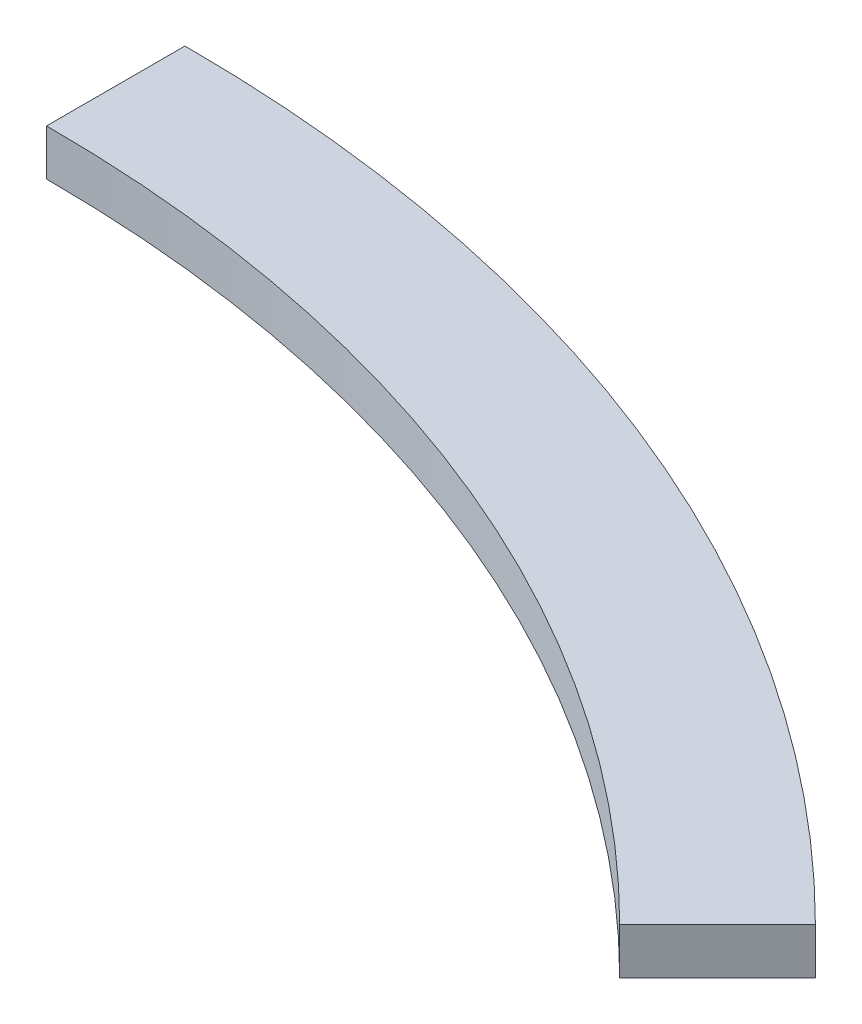
ISO-10303-21;
HEADER;
FILE_DESCRIPTION(('STEP AP214'),'2;1');
FILE_NAME('part.step','',(''),(''),'','','');
FILE_SCHEMA(('AUTOMOTIVE_DESIGN { 1 0 10303 214 1 1 1 1 }'));
ENDSEC;
DATA;
#1=APPLICATION_CONTEXT('core data for automotive mechanical design processes');
#2=APPLICATION_PROTOCOL_DEFINITION('international standard','automotive_design',2000,#1);
#3=PRODUCT_CONTEXT('',#1,'mechanical');
#4=PRODUCT('Part','Part','',(#3));
#5=PRODUCT_RELATED_PRODUCT_CATEGORY('part','',(#4));
#6=PRODUCT_DEFINITION_FORMATION('','',#4);
#7=PRODUCT_DEFINITION_CONTEXT('part definition',#1,'design');
#8=PRODUCT_DEFINITION('design','',#6,#7);
#9=PRODUCT_DEFINITION_SHAPE('','',#8);
#10=(LENGTH_UNIT() NAMED_UNIT(*) SI_UNIT(.MILLI.,.METRE.));
#11=(NAMED_UNIT(*) PLANE_ANGLE_UNIT() SI_UNIT($,.RADIAN.));
#12=(NAMED_UNIT(*) SI_UNIT($,.STERADIAN.) SOLID_ANGLE_UNIT());
#13=UNCERTAINTY_MEASURE_WITH_UNIT(LENGTH_MEASURE(1.E-05),#10,'distance_accuracy_value','');
#14=(GEOMETRIC_REPRESENTATION_CONTEXT(3) GLOBAL_UNCERTAINTY_ASSIGNED_CONTEXT((#13)) GLOBAL_UNIT_ASSIGNED_CONTEXT((#10,
#11,#12)) REPRESENTATION_CONTEXT('',''));
#15=CARTESIAN_POINT('',(0.,0.,0.));
#16=DIRECTION('',(0.,0.,1.));
#17=DIRECTION('',(1.,0.,0.));
#18=AXIS2_PLACEMENT_3D('',#15,#16,#17);
#19=CARTESIAN_POINT('',(0.,10.,0.));
#20=DIRECTION('',(0.,-1.,0.));
#21=DIRECTION('',(0.,0.,-1.));
#22=AXIS2_PLACEMENT_3D('',#19,#20,#21);
#23=CYLINDRICAL_SURFACE('',#22,330.);
#24=CARTESIAN_POINT('',(0.,0.,0.));
#25=DIRECTION('',(0.,1.,0.));
#26=DIRECTION('',(0.,0.,1.));
#27=AXIS2_PLACEMENT_3D('',#24,#25,#26);
#28=CIRCLE('',#27,330.);
#29=CARTESIAN_POINT('',(0.,0.,-330.));
#30=VERTEX_POINT('',#29);
#31=CARTESIAN_POINT('',(233.345237791561,0.,-233.34523779156));
#32=VERTEX_POINT('',#31);
#33=EDGE_CURVE('E99',#30,#32,#28,.F.);
#34=ORIENTED_EDGE('',*,*,#33,.F.);
#35=DIRECTION('',(0.,-1.,0.));
#36=VECTOR('',#35,1.);
#37=CARTESIAN_POINT('',(0.,10.,-330.));
#38=LINE('',#37,#36);
#39=CARTESIAN_POINT('',(0.,10.,-330.));
#40=VERTEX_POINT('',#39);
#41=EDGE_CURVE('E11',#40,#30,#38,.T.);
#42=ORIENTED_EDGE('',*,*,#41,.F.);
#43=CARTESIAN_POINT('',(0.,10.,0.));
#44=DIRECTION('',(0.,1.,0.));
#45=DIRECTION('',(0.,0.,1.));
#46=AXIS2_PLACEMENT_3D('',#43,#44,#45);
#47=CIRCLE('',#46,330.);
#48=CARTESIAN_POINT('',(233.345237791561,10.,-233.34523779156));
#49=VERTEX_POINT('',#48);
#50=EDGE_CURVE('E93',#40,#49,#47,.F.);
#51=ORIENTED_EDGE('',*,*,#50,.T.);
#52=DIRECTION('',(0.,-1.,0.));
#53=VECTOR('',#52,1.);
#54=CARTESIAN_POINT('',(233.345237791561,10.,-233.34523779156));
#55=LINE('',#54,#53);
#56=EDGE_CURVE('E74',#49,#32,#55,.T.);
#57=ORIENTED_EDGE('',*,*,#56,.T.);
#58=EDGE_LOOP('',(#34,#42,#51,#57));
#59=FACE_BOUND('',#58,.T.);
#60=ADVANCED_FACE('F36',(#59),#23,.T.);
#61=CARTESIAN_POINT('',(0.,10.,0.));
#62=DIRECTION('',(-1.,0.,0.));
#63=DIRECTION('',(0.,0.,1.));
#64=AXIS2_PLACEMENT_3D('',#61,#62,#63);
#65=PLANE('',#64);
#66=DIRECTION('',(0.,0.,-1.));
#67=VECTOR('',#66,1.);
#68=CARTESIAN_POINT('',(0.,0.,0.));
#69=LINE('',#68,#67);
#70=CARTESIAN_POINT('',(0.,0.,-300.));
#71=VERTEX_POINT('',#70);
#72=EDGE_CURVE('E87',#71,#30,#69,.T.);
#73=ORIENTED_EDGE('',*,*,#72,.F.);
#74=DIRECTION('',(0.,-1.,0.));
#75=VECTOR('',#74,1.);
#76=CARTESIAN_POINT('',(0.,10.,-300.));
#77=LINE('',#76,#75);
#78=CARTESIAN_POINT('',(0.,10.,-300.));
#79=VERTEX_POINT('',#78);
#80=EDGE_CURVE('E44',#79,#71,#77,.T.);
#81=ORIENTED_EDGE('',*,*,#80,.F.);
#82=DIRECTION('',(0.,0.,-1.));
#83=VECTOR('',#82,1.);
#84=CARTESIAN_POINT('',(0.,10.,0.));
#85=LINE('',#84,#83);
#86=EDGE_CURVE('E85',#79,#40,#85,.T.);
#87=ORIENTED_EDGE('',*,*,#86,.T.);
#88=ORIENTED_EDGE('',*,*,#41,.T.);
#89=EDGE_LOOP('',(#73,#81,#87,#88));
#90=FACE_BOUND('',#89,.T.);
#91=ADVANCED_FACE('F83',(#90),#65,.T.);
#92=CARTESIAN_POINT('',(0.,10.,0.));
#93=DIRECTION('',(0.,-1.,0.));
#94=DIRECTION('',(0.,0.,-1.));
#95=AXIS2_PLACEMENT_3D('',#92,#93,#94);
#96=CYLINDRICAL_SURFACE('',#95,300.);
#97=CARTESIAN_POINT('',(0.,0.,0.));
#98=DIRECTION('',(0.,1.,0.));
#99=DIRECTION('',(0.,0.,1.));
#100=AXIS2_PLACEMENT_3D('',#97,#98,#99);
#101=CIRCLE('',#100,300.);
#102=CARTESIAN_POINT('',(212.132034355965,0.,-212.132034355964));
#103=VERTEX_POINT('',#102);
#104=EDGE_CURVE('E67',#71,#103,#101,.F.);
#105=ORIENTED_EDGE('',*,*,#104,.T.);
#106=DIRECTION('',(0.,-1.,0.));
#107=VECTOR('',#106,1.);
#108=CARTESIAN_POINT('',(212.132034355965,10.,-212.132034355964));
#109=LINE('',#108,#107);
#110=CARTESIAN_POINT('',(212.132034355965,10.,-212.132034355964));
#111=VERTEX_POINT('',#110);
#112=EDGE_CURVE('E88',#111,#103,#109,.T.);
#113=ORIENTED_EDGE('',*,*,#112,.F.);
#114=CARTESIAN_POINT('',(0.,10.,0.));
#115=DIRECTION('',(0.,1.,0.));
#116=DIRECTION('',(0.,0.,1.));
#117=AXIS2_PLACEMENT_3D('',#114,#115,#116);
#118=CIRCLE('',#117,300.);
#119=EDGE_CURVE('E89',#79,#111,#118,.F.);
#120=ORIENTED_EDGE('',*,*,#119,.F.);
#121=ORIENTED_EDGE('',*,*,#80,.T.);
#122=EDGE_LOOP('',(#105,#113,#120,#121));
#123=FACE_BOUND('',#122,.T.);
#124=ADVANCED_FACE('F90',(#123),#96,.F.);
#125=CARTESIAN_POINT('',(0.,10.,0.));
#126=DIRECTION('',(-0.707106781186546,0.,-0.707106781186549));
#127=DIRECTION('',(-0.707106781186549,0.,0.707106781186546));
#128=AXIS2_PLACEMENT_3D('',#125,#126,#127);
#129=PLANE('',#128);
#130=DIRECTION('',(0.707106781186549,0.,-0.707106781186546));
#131=VECTOR('',#130,1.);
#132=CARTESIAN_POINT('',(0.,0.,0.));
#133=LINE('',#132,#131);
#134=EDGE_CURVE('E95',#103,#32,#133,.T.);
#135=ORIENTED_EDGE('',*,*,#134,.T.);
#136=ORIENTED_EDGE('',*,*,#56,.F.);
#137=DIRECTION('',(0.707106781186549,0.,-0.707106781186546));
#138=VECTOR('',#137,1.);
#139=CARTESIAN_POINT('',(0.,10.,0.));
#140=LINE('',#139,#138);
#141=EDGE_CURVE('E52',#111,#49,#140,.T.);
#142=ORIENTED_EDGE('',*,*,#141,.F.);
#143=ORIENTED_EDGE('',*,*,#112,.T.);
#144=EDGE_LOOP('',(#135,#136,#142,#143));
#145=FACE_BOUND('',#144,.T.);
#146=ADVANCED_FACE('F108',(#145),#129,.F.);
#147=CARTESIAN_POINT('',(0.,10.,0.));
#148=DIRECTION('',(0.,1.,0.));
#149=DIRECTION('',(0.,0.,1.));
#150=AXIS2_PLACEMENT_3D('',#147,#148,#149);
#151=PLANE('',#150);
#152=ORIENTED_EDGE('',*,*,#50,.F.);
#153=ORIENTED_EDGE('',*,*,#86,.F.);
#154=ORIENTED_EDGE('',*,*,#119,.T.);
#155=ORIENTED_EDGE('',*,*,#141,.T.);
#156=EDGE_LOOP('',(#152,#153,#154,#155));
#157=FACE_BOUND('',#156,.T.);
#158=ADVANCED_FACE('F92',(#157),#151,.T.);
#159=CARTESIAN_POINT('',(0.,0.,0.));
#160=DIRECTION('',(0.,1.,0.));
#161=DIRECTION('',(0.,0.,1.));
#162=AXIS2_PLACEMENT_3D('',#159,#160,#161);
#163=PLANE('',#162);
#164=ORIENTED_EDGE('',*,*,#33,.T.);
#165=ORIENTED_EDGE('',*,*,#134,.F.);
#166=ORIENTED_EDGE('',*,*,#104,.F.);
#167=ORIENTED_EDGE('',*,*,#72,.T.);
#168=EDGE_LOOP('',(#164,#165,#166,#167));
#169=FACE_BOUND('',#168,.T.);
#170=ADVANCED_FACE('F110',(#169),#163,.F.);
#171=CLOSED_SHELL('',(#60,#91,#124,#146,#158,#170));
#172=MANIFOLD_SOLID_BREP('B2',#171);
#173=ADVANCED_BREP_SHAPE_REPRESENTATION('',(#18,#172),#14);
#174=SHAPE_DEFINITION_REPRESENTATION(#9,#173);
ENDSEC;
END-ISO-10303-21;
